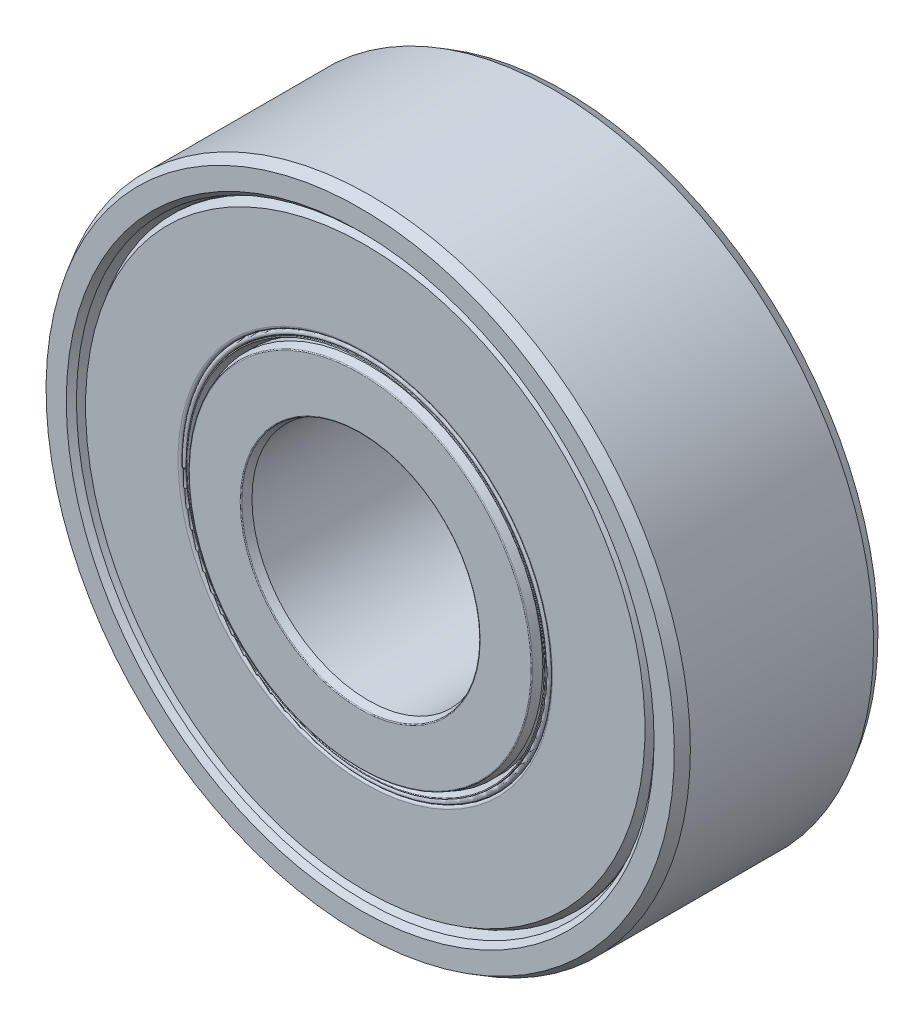
ISO-10303-21;
HEADER;
FILE_DESCRIPTION(('STEP AP214'),'2;1');
FILE_NAME('part.step','',(''),(''),'','','');
FILE_SCHEMA(('AUTOMOTIVE_DESIGN { 1 0 10303 214 1 1 1 1 }'));
ENDSEC;
DATA;
#1=APPLICATION_CONTEXT('core data for automotive mechanical design processes');
#2=APPLICATION_PROTOCOL_DEFINITION('international standard','automotive_design',2000,#1);
#3=PRODUCT_CONTEXT('',#1,'mechanical');
#4=PRODUCT('Part','Part','',(#3));
#5=PRODUCT_RELATED_PRODUCT_CATEGORY('part','',(#4));
#6=PRODUCT_DEFINITION_FORMATION('','',#4);
#7=PRODUCT_DEFINITION_CONTEXT('part definition',#1,'design');
#8=PRODUCT_DEFINITION('design','',#6,#7);
#9=PRODUCT_DEFINITION_SHAPE('','',#8);
#10=(LENGTH_UNIT() NAMED_UNIT(*) SI_UNIT(.MILLI.,.METRE.));
#11=(NAMED_UNIT(*) PLANE_ANGLE_UNIT() SI_UNIT($,.RADIAN.));
#12=(NAMED_UNIT(*) SI_UNIT($,.STERADIAN.) SOLID_ANGLE_UNIT());
#13=UNCERTAINTY_MEASURE_WITH_UNIT(LENGTH_MEASURE(1.E-05),#10,'distance_accuracy_value','');
#14=(GEOMETRIC_REPRESENTATION_CONTEXT(3) GLOBAL_UNCERTAINTY_ASSIGNED_CONTEXT((#13)) GLOBAL_UNIT_ASSIGNED_CONTEXT((#10,
#11,#12)) REPRESENTATION_CONTEXT('',''));
#15=CARTESIAN_POINT('',(0.,0.,0.));
#16=DIRECTION('',(0.,0.,1.));
#17=DIRECTION('',(1.,0.,0.));
#18=AXIS2_PLACEMENT_3D('',#15,#16,#17);
#19=CARTESIAN_POINT('',(0.,0.,3.5));
#20=DIRECTION('',(0.,0.,1.));
#21=DIRECTION('',(0.,-1.,0.));
#22=AXIS2_PLACEMENT_3D('',#19,#20,#21);
#23=CYLINDRICAL_SURFACE('',#22,6.34803966942149);
#24=CARTESIAN_POINT('',(0.,0.,-2.50098016528926));
#25=DIRECTION('',(0.,0.,1.));
#26=DIRECTION('',(0.,-1.,0.));
#27=AXIS2_PLACEMENT_3D('',#24,#25,#26);
#28=CIRCLE('',#27,6.34803966942149);
#29=CARTESIAN_POINT('',(0.,-6.34803966942148,-2.50098016528926));
#30=VERTEX_POINT('',#29);
#31=EDGE_CURVE('E11',#30,#30,#28,.T.);
#32=ORIENTED_EDGE('',*,*,#31,.F.);
#33=EDGE_LOOP('',(#32));
#34=FACE_BOUND('',#33,.T.);
#35=CARTESIAN_POINT('',(0.,0.,-3.2375));
#36=DIRECTION('',(0.,0.,1.));
#37=DIRECTION('',(0.,-1.,0.));
#38=AXIS2_PLACEMENT_3D('',#35,#36,#37);
#39=CIRCLE('',#38,6.34803966942149);
#40=CARTESIAN_POINT('',(0.,-6.34803966942149,-3.2375));
#41=VERTEX_POINT('',#40);
#42=EDGE_CURVE('E82',#41,#41,#39,.T.);
#43=ORIENTED_EDGE('',*,*,#42,.T.);
#44=EDGE_LOOP('',(#43));
#45=FACE_BOUND('',#44,.T.);
#46=ADVANCED_FACE('F50',(#34,#45),#23,.T.);
#47=CARTESIAN_POINT('',(0.,6.34803966942149,-2.50098016528926));
#48=DIRECTION('',(0.,0.,-1.));
#49=DIRECTION('',(0.,1.,0.));
#50=AXIS2_PLACEMENT_3D('',#47,#48,#49);
#51=PLANE('',#50);
#52=CARTESIAN_POINT('',(0.,0.,-2.50098016528926));
#53=DIRECTION('',(0.,0.,1.));
#54=DIRECTION('',(0.,-1.,0.));
#55=AXIS2_PLACEMENT_3D('',#52,#53,#54);
#56=CIRCLE('',#55,5.99803966942149);
#57=CARTESIAN_POINT('',(0.,-5.99803966942149,-2.50098016528926));
#58=VERTEX_POINT('',#57);
#59=EDGE_CURVE('E57',#58,#58,#56,.T.);
#60=ORIENTED_EDGE('',*,*,#59,.F.);
#61=EDGE_LOOP('',(#60));
#62=FACE_BOUND('',#61,.T.);
#63=ORIENTED_EDGE('',*,*,#31,.T.);
#64=EDGE_LOOP('',(#63));
#65=FACE_BOUND('',#64,.T.);
#66=ADVANCED_FACE('F113',(#62,#65),#51,.F.);
#67=CARTESIAN_POINT('',(0.,0.,3.5));
#68=DIRECTION('',(0.,0.,1.));
#69=DIRECTION('',(0.,-1.,0.));
#70=AXIS2_PLACEMENT_3D('',#67,#68,#69);
#71=CYLINDRICAL_SURFACE('',#70,5.99803966942149);
#72=CARTESIAN_POINT('',(0.,0.,-2.92593888343875));
#73=DIRECTION('',(0.,0.,1.));
#74=DIRECTION('',(0.,-1.,0.));
#75=AXIS2_PLACEMENT_3D('',#72,#73,#74);
#76=CIRCLE('',#75,5.99803966942149);
#77=CARTESIAN_POINT('',(0.,-5.99803966942149,-2.92593888343875));
#78=VERTEX_POINT('',#77);
#79=EDGE_CURVE('E63',#78,#78,#76,.T.);
#80=ORIENTED_EDGE('',*,*,#79,.F.);
#81=EDGE_LOOP('',(#80));
#82=FACE_BOUND('',#81,.T.);
#83=ORIENTED_EDGE('',*,*,#59,.T.);
#84=EDGE_LOOP('',(#83));
#85=FACE_BOUND('',#84,.T.);
#86=ADVANCED_FACE('F108',(#82,#85),#71,.F.);
#87=CARTESIAN_POINT('',(0.,0.,-2.92593888343875));
#88=DIRECTION('',(0.,0.,-1.));
#89=DIRECTION('',(0.,1.,0.));
#90=AXIS2_PLACEMENT_3D('',#87,#88,#89);
#91=CONICAL_SURFACE('',#90,5.99803966942149,0.349065850398868);
#92=CARTESIAN_POINT('',(0.,0.,-3.3134853525082));
#93=DIRECTION('',(0.,0.,1.));
#94=DIRECTION('',(0.,-1.,0.));
#95=AXIS2_PLACEMENT_3D('',#92,#93,#94);
#96=CIRCLE('',#95,6.13909504855773);
#97=CARTESIAN_POINT('',(0.,-6.13909504855773,-3.3134853525082));
#98=VERTEX_POINT('',#97);
#99=EDGE_CURVE('E69',#98,#98,#96,.T.);
#100=ORIENTED_EDGE('',*,*,#99,.F.);
#101=EDGE_LOOP('',(#100));
#102=FACE_BOUND('',#101,.T.);
#103=ORIENTED_EDGE('',*,*,#79,.T.);
#104=EDGE_LOOP('',(#103));
#105=FACE_BOUND('',#104,.T.);
#106=ADVANCED_FACE('F102',(#102,#105),#91,.F.);
#107=CARTESIAN_POINT('',(0.,0.,-3.3075));
#108=DIRECTION('',(0.,0.,1.));
#109=DIRECTION('',(0.,-1.,0.));
#110=AXIS2_PLACEMENT_3D('',#107,#108,#109);
#111=TOROIDAL_SURFACE('',#110,6.15553966942149,0.0174999999999998);
#112=CARTESIAN_POINT('',(0.,0.,-3.3075));
#113=DIRECTION('',(0.,0.,1.));
#114=DIRECTION('',(0.,-1.,0.));
#115=AXIS2_PLACEMENT_3D('',#112,#113,#114);
#116=CIRCLE('',#115,6.17303966942149);
#117=CARTESIAN_POINT('',(0.,-6.17303966942149,-3.3075));
#118=VERTEX_POINT('',#117);
#119=EDGE_CURVE('E75',#118,#118,#116,.T.);
#120=ORIENTED_EDGE('',*,*,#119,.F.);
#121=EDGE_LOOP('',(#120));
#122=FACE_BOUND('',#121,.T.);
#123=ORIENTED_EDGE('',*,*,#99,.T.);
#124=EDGE_LOOP('',(#123));
#125=FACE_BOUND('',#124,.T.);
#126=ADVANCED_FACE('F96',(#122,#125),#111,.T.);
#127=CARTESIAN_POINT('',(0.,0.,3.5));
#128=DIRECTION('',(0.,0.,1.));
#129=DIRECTION('',(0.,-1.,0.));
#130=AXIS2_PLACEMENT_3D('',#127,#128,#129);
#131=CYLINDRICAL_SURFACE('',#130,6.17303966942149);
#132=CARTESIAN_POINT('',(0.,0.,-3.2375));
#133=DIRECTION('',(0.,0.,1.));
#134=DIRECTION('',(0.,-1.,0.));
#135=AXIS2_PLACEMENT_3D('',#132,#133,#134);
#136=CIRCLE('',#135,6.17303966942149);
#137=CARTESIAN_POINT('',(0.,-6.17303966942149,-3.2375));
#138=VERTEX_POINT('',#137);
#139=EDGE_CURVE('E79',#138,#138,#136,.T.);
#140=ORIENTED_EDGE('',*,*,#139,.F.);
#141=EDGE_LOOP('',(#140));
#142=FACE_BOUND('',#141,.T.);
#143=ORIENTED_EDGE('',*,*,#119,.T.);
#144=EDGE_LOOP('',(#143));
#145=FACE_BOUND('',#144,.T.);
#146=ADVANCED_FACE('F90',(#142,#145),#131,.T.);
#147=CARTESIAN_POINT('',(0.,0.,-3.2375));
#148=DIRECTION('',(0.,0.,1.));
#149=DIRECTION('',(0.,-1.,0.));
#150=AXIS2_PLACEMENT_3D('',#147,#148,#149);
#151=TOROIDAL_SURFACE('',#150,6.26053966942149,0.0875000000000008);
#152=ORIENTED_EDGE('',*,*,#42,.F.);
#153=EDGE_LOOP('',(#152));
#154=FACE_BOUND('',#153,.T.);
#155=ORIENTED_EDGE('',*,*,#139,.T.);
#156=EDGE_LOOP('',(#155));
#157=FACE_BOUND('',#156,.T.);
#158=ADVANCED_FACE('F87',(#154,#157),#151,.T.);
#159=CLOSED_SHELL('',(#46,#66,#86,#106,#126,#146,#158));
#160=MANIFOLD_SOLID_BREP('B2',#159);
#161=CARTESIAN_POINT('',(0.,6.34803966942149,2.50098016528926));
#162=DIRECTION('',(0.,0.,1.));
#163=DIRECTION('',(0.,-1.,0.));
#164=AXIS2_PLACEMENT_3D('',#161,#162,#163);
#165=PLANE('',#164);
#166=CARTESIAN_POINT('',(0.,0.,2.50098016528926));
#167=DIRECTION('',(0.,0.,1.));
#168=DIRECTION('',(0.,-1.,0.));
#169=AXIS2_PLACEMENT_3D('',#166,#167,#168);
#170=CIRCLE('',#169,6.34803966942149);
#171=CARTESIAN_POINT('',(0.,-6.34803966942149,2.50098016528925));
#172=VERTEX_POINT('',#171);
#173=EDGE_CURVE('E197',#172,#172,#170,.T.);
#174=ORIENTED_EDGE('',*,*,#173,.F.);
#175=EDGE_LOOP('',(#174));
#176=FACE_BOUND('',#175,.T.);
#177=CARTESIAN_POINT('',(0.,0.,2.50098016528926));
#178=DIRECTION('',(0.,0.,1.));
#179=DIRECTION('',(0.,-1.,0.));
#180=AXIS2_PLACEMENT_3D('',#177,#178,#179);
#181=CIRCLE('',#180,5.99803966942149);
#182=CARTESIAN_POINT('',(0.,-5.99803966942149,2.50098016528925));
#183=VERTEX_POINT('',#182);
#184=EDGE_CURVE('E49',#183,#183,#181,.T.);
#185=ORIENTED_EDGE('',*,*,#184,.T.);
#186=EDGE_LOOP('',(#185));
#187=FACE_BOUND('',#186,.T.);
#188=ADVANCED_FACE('F165',(#176,#187),#165,.F.);
#189=CARTESIAN_POINT('',(0.,0.,3.5));
#190=DIRECTION('',(0.,0.,1.));
#191=DIRECTION('',(0.,-1.,0.));
#192=AXIS2_PLACEMENT_3D('',#189,#190,#191);
#193=CYLINDRICAL_SURFACE('',#192,5.99803966942149);
#194=ORIENTED_EDGE('',*,*,#184,.F.);
#195=EDGE_LOOP('',(#194));
#196=FACE_BOUND('',#195,.T.);
#197=CARTESIAN_POINT('',(0.,0.,2.92593888343875));
#198=DIRECTION('',(0.,0.,1.));
#199=DIRECTION('',(0.,-1.,0.));
#200=AXIS2_PLACEMENT_3D('',#197,#198,#199);
#201=CIRCLE('',#200,5.99803966942149);
#202=CARTESIAN_POINT('',(0.,-5.99803966942149,2.92593888343875));
#203=VERTEX_POINT('',#202);
#204=EDGE_CURVE('E172',#203,#203,#201,.T.);
#205=ORIENTED_EDGE('',*,*,#204,.T.);
#206=EDGE_LOOP('',(#205));
#207=FACE_BOUND('',#206,.T.);
#208=ADVANCED_FACE('F204',(#196,#207),#193,.F.);
#209=CARTESIAN_POINT('',(0.,0.,3.3134853525082));
#210=DIRECTION('',(0.,0.,1.));
#211=DIRECTION('',(0.,-1.,0.));
#212=AXIS2_PLACEMENT_3D('',#209,#210,#211);
#213=CONICAL_SURFACE('',#212,6.13909504855773,0.349065850398868);
#214=ORIENTED_EDGE('',*,*,#204,.F.);
#215=EDGE_LOOP('',(#214));
#216=FACE_BOUND('',#215,.T.);
#217=CARTESIAN_POINT('',(0.,0.,3.3134853525082));
#218=DIRECTION('',(0.,0.,1.));
#219=DIRECTION('',(0.,-1.,0.));
#220=AXIS2_PLACEMENT_3D('',#217,#218,#219);
#221=CIRCLE('',#220,6.13909504855773);
#222=CARTESIAN_POINT('',(0.,-6.13909504855773,3.3134853525082));
#223=VERTEX_POINT('',#222);
#224=EDGE_CURVE('E178',#223,#223,#221,.T.);
#225=ORIENTED_EDGE('',*,*,#224,.T.);
#226=EDGE_LOOP('',(#225));
#227=FACE_BOUND('',#226,.T.);
#228=ADVANCED_FACE('F208',(#216,#227),#213,.F.);
#229=CARTESIAN_POINT('',(0.,0.,3.3075));
#230=DIRECTION('',(0.,0.,1.));
#231=DIRECTION('',(0.,-1.,0.));
#232=AXIS2_PLACEMENT_3D('',#229,#230,#231);
#233=TOROIDAL_SURFACE('',#232,6.15553966942149,0.0174999999999998);
#234=ORIENTED_EDGE('',*,*,#224,.F.);
#235=EDGE_LOOP('',(#234));
#236=FACE_BOUND('',#235,.T.);
#237=CARTESIAN_POINT('',(0.,0.,3.3075));
#238=DIRECTION('',(0.,0.,1.));
#239=DIRECTION('',(0.,-1.,0.));
#240=AXIS2_PLACEMENT_3D('',#237,#238,#239);
#241=CIRCLE('',#240,6.17303966942149);
#242=CARTESIAN_POINT('',(0.,-6.17303966942149,3.3075));
#243=VERTEX_POINT('',#242);
#244=EDGE_CURVE('E184',#243,#243,#241,.T.);
#245=ORIENTED_EDGE('',*,*,#244,.T.);
#246=EDGE_LOOP('',(#245));
#247=FACE_BOUND('',#246,.T.);
#248=ADVANCED_FACE('F213',(#236,#247),#233,.T.);
#249=CARTESIAN_POINT('',(0.,0.,3.5));
#250=DIRECTION('',(0.,0.,1.));
#251=DIRECTION('',(0.,-1.,0.));
#252=AXIS2_PLACEMENT_3D('',#249,#250,#251);
#253=CYLINDRICAL_SURFACE('',#252,6.17303966942149);
#254=ORIENTED_EDGE('',*,*,#244,.F.);
#255=EDGE_LOOP('',(#254));
#256=FACE_BOUND('',#255,.T.);
#257=CARTESIAN_POINT('',(0.,0.,3.2375));
#258=DIRECTION('',(0.,0.,1.));
#259=DIRECTION('',(0.,-1.,0.));
#260=AXIS2_PLACEMENT_3D('',#257,#258,#259);
#261=CIRCLE('',#260,6.17303966942149);
#262=CARTESIAN_POINT('',(0.,-6.17303966942149,3.2375));
#263=VERTEX_POINT('',#262);
#264=EDGE_CURVE('E190',#263,#263,#261,.T.);
#265=ORIENTED_EDGE('',*,*,#264,.T.);
#266=EDGE_LOOP('',(#265));
#267=FACE_BOUND('',#266,.T.);
#268=ADVANCED_FACE('F219',(#256,#267),#253,.T.);
#269=CARTESIAN_POINT('',(0.,0.,3.2375));
#270=DIRECTION('',(0.,0.,1.));
#271=DIRECTION('',(0.,-1.,0.));
#272=AXIS2_PLACEMENT_3D('',#269,#270,#271);
#273=TOROIDAL_SURFACE('',#272,6.26053966942149,0.0875000000000008);
#274=ORIENTED_EDGE('',*,*,#264,.F.);
#275=EDGE_LOOP('',(#274));
#276=FACE_BOUND('',#275,.T.);
#277=CARTESIAN_POINT('',(0.,0.,3.2375));
#278=DIRECTION('',(0.,0.,1.));
#279=DIRECTION('',(0.,-1.,0.));
#280=AXIS2_PLACEMENT_3D('',#277,#278,#279);
#281=CIRCLE('',#280,6.34803966942149);
#282=CARTESIAN_POINT('',(0.,-6.34803966942149,3.2375));
#283=VERTEX_POINT('',#282);
#284=EDGE_CURVE('E193',#283,#283,#281,.T.);
#285=ORIENTED_EDGE('',*,*,#284,.T.);
#286=EDGE_LOOP('',(#285));
#287=FACE_BOUND('',#286,.T.);
#288=ADVANCED_FACE('F223',(#276,#287),#273,.T.);
#289=CARTESIAN_POINT('',(0.,0.,3.5));
#290=DIRECTION('',(0.,0.,1.));
#291=DIRECTION('',(0.,-1.,0.));
#292=AXIS2_PLACEMENT_3D('',#289,#290,#291);
#293=CYLINDRICAL_SURFACE('',#292,6.34803966942149);
#294=ORIENTED_EDGE('',*,*,#284,.F.);
#295=EDGE_LOOP('',(#294));
#296=FACE_BOUND('',#295,.T.);
#297=ORIENTED_EDGE('',*,*,#173,.T.);
#298=EDGE_LOOP('',(#297));
#299=FACE_BOUND('',#298,.T.);
#300=ADVANCED_FACE('F201',(#296,#299),#293,.T.);
#301=CLOSED_SHELL('',(#188,#208,#228,#248,#268,#288,#300));
#302=MANIFOLD_SOLID_BREP('B6',#301);
#303=CARTESIAN_POINT('',(0.,0.,-3.325));
#304=DIRECTION('',(0.,0.,1.));
#305=DIRECTION('',(0.,-1.,0.));
#306=AXIS2_PLACEMENT_3D('',#303,#304,#305);
#307=CONICAL_SURFACE('',#306,9.615,0.52359877559829);
#308=CARTESIAN_POINT('',(0.,0.,-3.02189110867545));
#309=DIRECTION('',(0.,0.,1.));
#310=DIRECTION('',(0.,-1.,0.));
#311=AXIS2_PLACEMENT_3D('',#308,#309,#310);
#312=CIRCLE('',#311,9.79);
#313=CARTESIAN_POINT('',(0.,-9.79,-3.02189110867545));
#314=VERTEX_POINT('',#313);
#315=EDGE_CURVE('E301',#314,#314,#312,.T.);
#316=ORIENTED_EDGE('',*,*,#315,.F.);
#317=EDGE_LOOP('',(#316));
#318=FACE_BOUND('',#317,.T.);
#319=CARTESIAN_POINT('',(0.,0.,-3.325));
#320=DIRECTION('',(0.,0.,1.));
#321=DIRECTION('',(0.,-1.,0.));
#322=AXIS2_PLACEMENT_3D('',#319,#320,#321);
#323=CIRCLE('',#322,9.615);
#324=CARTESIAN_POINT('',(0.,-9.615,-3.32500000000001));
#325=VERTEX_POINT('',#324);
#326=EDGE_CURVE('E164',#325,#325,#323,.T.);
#327=ORIENTED_EDGE('',*,*,#326,.T.);
#328=EDGE_LOOP('',(#327));
#329=FACE_BOUND('',#328,.T.);
#330=ADVANCED_FACE('F273',(#318,#329),#307,.T.);
#331=CARTESIAN_POINT('',(0.,9.615,-3.325));
#332=DIRECTION('',(0.,0.,1.));
#333=DIRECTION('',(0.,-1.,0.));
#334=AXIS2_PLACEMENT_3D('',#331,#332,#333);
#335=PLANE('',#334);
#336=ORIENTED_EDGE('',*,*,#326,.F.);
#337=EDGE_LOOP('',(#336));
#338=FACE_BOUND('',#337,.T.);
#339=CARTESIAN_POINT('',(0.,0.,-3.325));
#340=DIRECTION('',(0.,0.,1.));
#341=DIRECTION('',(0.,-1.,0.));
#342=AXIS2_PLACEMENT_3D('',#339,#340,#341);
#343=CIRCLE('',#342,6.43553966942149);
#344=CARTESIAN_POINT('',(0.,-6.43553966942149,-3.32500000000001));
#345=VERTEX_POINT('',#344);
#346=EDGE_CURVE('E280',#345,#345,#343,.T.);
#347=ORIENTED_EDGE('',*,*,#346,.T.);
#348=EDGE_LOOP('',(#347));
#349=FACE_BOUND('',#348,.T.);
#350=ADVANCED_FACE('F308',(#338,#349),#335,.F.);
#351=CARTESIAN_POINT('',(0.,0.,-3.2375));
#352=DIRECTION('',(0.,0.,1.));
#353=DIRECTION('',(0.,-1.,0.));
#354=AXIS2_PLACEMENT_3D('',#351,#352,#353);
#355=TOROIDAL_SURFACE('',#354,6.43553966942149,0.0874999999999997);
#356=ORIENTED_EDGE('',*,*,#346,.F.);
#357=EDGE_LOOP('',(#356));
#358=FACE_BOUND('',#357,.T.);
#359=CARTESIAN_POINT('',(0.,0.,-3.2375));
#360=DIRECTION('',(0.,0.,1.));
#361=DIRECTION('',(0.,-1.,0.));
#362=AXIS2_PLACEMENT_3D('',#359,#360,#361);
#363=CIRCLE('',#362,6.34803966942149);
#364=CARTESIAN_POINT('',(0.,-6.34803966942149,-3.2375));
#365=VERTEX_POINT('',#364);
#366=EDGE_CURVE('E287',#365,#365,#363,.T.);
#367=ORIENTED_EDGE('',*,*,#366,.T.);
#368=EDGE_LOOP('',(#367));
#369=FACE_BOUND('',#368,.T.);
#370=ADVANCED_FACE('F312',(#358,#369),#355,.T.);
#371=CARTESIAN_POINT('',(0.,0.,3.5));
#372=DIRECTION('',(0.,0.,1.));
#373=DIRECTION('',(0.,-1.,0.));
#374=AXIS2_PLACEMENT_3D('',#371,#372,#373);
#375=CYLINDRICAL_SURFACE('',#374,6.34803966942149);
#376=ORIENTED_EDGE('',*,*,#366,.F.);
#377=EDGE_LOOP('',(#376));
#378=FACE_BOUND('',#377,.T.);
#379=CARTESIAN_POINT('',(0.,0.,-2.50098016528926));
#380=DIRECTION('',(0.,0.,1.));
#381=DIRECTION('',(0.,-1.,0.));
#382=AXIS2_PLACEMENT_3D('',#379,#380,#381);
#383=CIRCLE('',#382,6.34803966942149);
#384=CARTESIAN_POINT('',(0.,-6.34803966942149,-2.50098016528926));
#385=VERTEX_POINT('',#384);
#386=EDGE_CURVE('E292',#385,#385,#383,.T.);
#387=ORIENTED_EDGE('',*,*,#386,.T.);
#388=EDGE_LOOP('',(#387));
#389=FACE_BOUND('',#388,.T.);
#390=ADVANCED_FACE('F318',(#378,#389),#375,.F.);
#391=CARTESIAN_POINT('',(0.,9.79,-2.50098016528926));
#392=DIRECTION('',(0.,0.,-1.));
#393=DIRECTION('',(0.,1.,0.));
#394=AXIS2_PLACEMENT_3D('',#391,#392,#393);
#395=PLANE('',#394);
#396=ORIENTED_EDGE('',*,*,#386,.F.);
#397=EDGE_LOOP('',(#396));
#398=FACE_BOUND('',#397,.T.);
#399=CARTESIAN_POINT('',(0.,0.,-2.50098016528926));
#400=DIRECTION('',(0.,0.,1.));
#401=DIRECTION('',(0.,-1.,0.));
#402=AXIS2_PLACEMENT_3D('',#399,#400,#401);
#403=CIRCLE('',#402,9.79);
#404=CARTESIAN_POINT('',(0.,-9.79,-2.50098016528926));
#405=VERTEX_POINT('',#404);
#406=EDGE_CURVE('E297',#405,#405,#403,.T.);
#407=ORIENTED_EDGE('',*,*,#406,.T.);
#408=EDGE_LOOP('',(#407));
#409=FACE_BOUND('',#408,.T.);
#410=ADVANCED_FACE('F323',(#398,#409),#395,.F.);
#411=CARTESIAN_POINT('',(0.,0.,3.5));
#412=DIRECTION('',(0.,0.,1.));
#413=DIRECTION('',(0.,-1.,0.));
#414=AXIS2_PLACEMENT_3D('',#411,#412,#413);
#415=CYLINDRICAL_SURFACE('',#414,9.79);
#416=ORIENTED_EDGE('',*,*,#406,.F.);
#417=EDGE_LOOP('',(#416));
#418=FACE_BOUND('',#417,.T.);
#419=ORIENTED_EDGE('',*,*,#315,.T.);
#420=EDGE_LOOP('',(#419));
#421=FACE_BOUND('',#420,.T.);
#422=ADVANCED_FACE('F305',(#418,#421),#415,.T.);
#423=CLOSED_SHELL('',(#330,#350,#370,#390,#410,#422));
#424=MANIFOLD_SOLID_BREP('B44',#423);
#425=CARTESIAN_POINT('',(0.,9.79,2.50098016528926));
#426=DIRECTION('',(0.,0.,1.));
#427=DIRECTION('',(0.,-1.,0.));
#428=AXIS2_PLACEMENT_3D('',#425,#426,#427);
#429=PLANE('',#428);
#430=CARTESIAN_POINT('',(0.,0.,2.50098016528925));
#431=DIRECTION('',(0.,0.,1.));
#432=DIRECTION('',(0.,-1.,0.));
#433=AXIS2_PLACEMENT_3D('',#430,#431,#432);
#434=CIRCLE('',#433,9.79);
#435=CARTESIAN_POINT('',(0.,-9.79,2.50098016528925));
#436=VERTEX_POINT('',#435);
#437=EDGE_CURVE('E272',#436,#436,#434,.T.);
#438=ORIENTED_EDGE('',*,*,#437,.F.);
#439=EDGE_LOOP('',(#438));
#440=FACE_BOUND('',#439,.T.);
#441=CARTESIAN_POINT('',(0.,0.,2.50098016528926));
#442=DIRECTION('',(0.,0.,1.));
#443=DIRECTION('',(0.,-1.,0.));
#444=AXIS2_PLACEMENT_3D('',#441,#442,#443);
#445=CIRCLE('',#444,6.34803966942149);
#446=CARTESIAN_POINT('',(0.,-6.34803966942149,2.50098016528925));
#447=VERTEX_POINT('',#446);
#448=EDGE_CURVE('E398',#447,#447,#445,.T.);
#449=ORIENTED_EDGE('',*,*,#448,.T.);
#450=EDGE_LOOP('',(#449));
#451=FACE_BOUND('',#450,.T.);
#452=ADVANCED_FACE('F371',(#440,#451),#429,.F.);
#453=CARTESIAN_POINT('',(0.,0.,3.5));
#454=DIRECTION('',(0.,0.,1.));
#455=DIRECTION('',(0.,-1.,0.));
#456=AXIS2_PLACEMENT_3D('',#453,#454,#455);
#457=CYLINDRICAL_SURFACE('',#456,9.79);
#458=CARTESIAN_POINT('',(0.,0.,3.02189110867544));
#459=DIRECTION('',(0.,0.,1.));
#460=DIRECTION('',(0.,-1.,0.));
#461=AXIS2_PLACEMENT_3D('',#458,#459,#460);
#462=CIRCLE('',#461,9.79);
#463=CARTESIAN_POINT('',(0.,-9.79,3.02189110867544));
#464=VERTEX_POINT('',#463);
#465=EDGE_CURVE('E378',#464,#464,#462,.T.);
#466=ORIENTED_EDGE('',*,*,#465,.F.);
#467=EDGE_LOOP('',(#466));
#468=FACE_BOUND('',#467,.T.);
#469=ORIENTED_EDGE('',*,*,#437,.T.);
#470=EDGE_LOOP('',(#469));
#471=FACE_BOUND('',#470,.T.);
#472=ADVANCED_FACE('F424',(#468,#471),#457,.T.);
#473=CARTESIAN_POINT('',(0.,0.,3.02189110867544));
#474=DIRECTION('',(0.,0.,-1.));
#475=DIRECTION('',(0.,1.,0.));
#476=AXIS2_PLACEMENT_3D('',#473,#474,#475);
#477=CONICAL_SURFACE('',#476,9.79,0.52359877559829);
#478=CARTESIAN_POINT('',(0.,0.,3.325));
#479=DIRECTION('',(0.,0.,1.));
#480=DIRECTION('',(0.,-1.,0.));
#481=AXIS2_PLACEMENT_3D('',#478,#479,#480);
#482=CIRCLE('',#481,9.615);
#483=CARTESIAN_POINT('',(0.,-9.615,3.325));
#484=VERTEX_POINT('',#483);
#485=EDGE_CURVE('E384',#484,#484,#482,.T.);
#486=ORIENTED_EDGE('',*,*,#485,.F.);
#487=EDGE_LOOP('',(#486));
#488=FACE_BOUND('',#487,.T.);
#489=ORIENTED_EDGE('',*,*,#465,.T.);
#490=EDGE_LOOP('',(#489));
#491=FACE_BOUND('',#490,.T.);
#492=ADVANCED_FACE('F419',(#488,#491),#477,.T.);
#493=CARTESIAN_POINT('',(0.,9.615,3.325));
#494=DIRECTION('',(0.,0.,-1.));
#495=DIRECTION('',(0.,1.,0.));
#496=AXIS2_PLACEMENT_3D('',#493,#494,#495);
#497=PLANE('',#496);
#498=CARTESIAN_POINT('',(0.,0.,3.325));
#499=DIRECTION('',(0.,0.,1.));
#500=DIRECTION('',(0.,-1.,0.));
#501=AXIS2_PLACEMENT_3D('',#498,#499,#500);
#502=CIRCLE('',#501,6.43553966942149);
#503=CARTESIAN_POINT('',(0.,-6.43553966942149,3.325));
#504=VERTEX_POINT('',#503);
#505=EDGE_CURVE('E389',#504,#504,#502,.T.);
#506=ORIENTED_EDGE('',*,*,#505,.F.);
#507=EDGE_LOOP('',(#506));
#508=FACE_BOUND('',#507,.T.);
#509=ORIENTED_EDGE('',*,*,#485,.T.);
#510=EDGE_LOOP('',(#509));
#511=FACE_BOUND('',#510,.T.);
#512=ADVANCED_FACE('F413',(#508,#511),#497,.F.);
#513=CARTESIAN_POINT('',(0.,0.,3.2375));
#514=DIRECTION('',(0.,0.,1.));
#515=DIRECTION('',(0.,-1.,0.));
#516=AXIS2_PLACEMENT_3D('',#513,#514,#515);
#517=TOROIDAL_SURFACE('',#516,6.43553966942149,0.0874999999999997);
#518=CARTESIAN_POINT('',(0.,0.,3.2375));
#519=DIRECTION('',(0.,0.,1.));
#520=DIRECTION('',(0.,-1.,0.));
#521=AXIS2_PLACEMENT_3D('',#518,#519,#520);
#522=CIRCLE('',#521,6.34803966942149);
#523=CARTESIAN_POINT('',(0.,-6.34803966942149,3.2375));
#524=VERTEX_POINT('',#523);
#525=EDGE_CURVE('E394',#524,#524,#522,.T.);
#526=ORIENTED_EDGE('',*,*,#525,.F.);
#527=EDGE_LOOP('',(#526));
#528=FACE_BOUND('',#527,.T.);
#529=ORIENTED_EDGE('',*,*,#505,.T.);
#530=EDGE_LOOP('',(#529));
#531=FACE_BOUND('',#530,.T.);
#532=ADVANCED_FACE('F407',(#528,#531),#517,.T.);
#533=CARTESIAN_POINT('',(0.,0.,3.5));
#534=DIRECTION('',(0.,0.,1.));
#535=DIRECTION('',(0.,-1.,0.));
#536=AXIS2_PLACEMENT_3D('',#533,#534,#535);
#537=CYLINDRICAL_SURFACE('',#536,6.34803966942149);
#538=ORIENTED_EDGE('',*,*,#448,.F.);
#539=EDGE_LOOP('',(#538));
#540=FACE_BOUND('',#539,.T.);
#541=ORIENTED_EDGE('',*,*,#525,.T.);
#542=EDGE_LOOP('',(#541));
#543=FACE_BOUND('',#542,.T.);
#544=ADVANCED_FACE('F404',(#540,#543),#537,.F.);
#545=CLOSED_SHELL('',(#452,#472,#492,#512,#532,#544));
#546=MANIFOLD_SOLID_BREP('B159',#545);
#547=CARTESIAN_POINT('',(-6.17179323000387,4.92184086261279,0.));
#548=DIRECTION('',(0.,0.,1.));
#549=DIRECTION('',(-0.781831482468022,0.623489801858743,0.));
#550=AXIS2_PLACEMENT_3D('',#547,#548,#549);
#551=SPHERICAL_SURFACE('',#550,2.50098016528926);
#552=CARTESIAN_POINT('',(-6.17179323000387,4.92184086261279,2.50098016528925));
#553=VERTEX_POINT('',#552);
#554=VERTEX_LOOP('',#553);
#555=FACE_BOUND('',#554,.T.);
#556=ADVANCED_FACE('F483',(#555),#551,.T.);
#557=CLOSED_SHELL('',(#556));
#558=MANIFOLD_SOLID_BREP('B267',#557);
#559=CARTESIAN_POINT('',(-7.69610027617647,-1.75658466628943,0.));
#560=DIRECTION('',(0.,0.,1.));
#561=DIRECTION('',(-0.974927912181826,-0.222520933956305,0.));
#562=AXIS2_PLACEMENT_3D('',#559,#560,#561);
#563=SPHERICAL_SURFACE('',#562,2.50098016528926);
#564=CARTESIAN_POINT('',(-7.69610027617647,-1.75658466628943,2.50098016528925));
#565=VERTEX_POINT('',#564);
#566=VERTEX_LOOP('',#565);
#567=FACE_BOUND('',#566,.T.);
#568=ADVANCED_FACE('F500',(#567),#563,.T.);
#569=CLOSED_SHELL('',(#568));
#570=MANIFOLD_SOLID_BREP('B367',#569);
#571=CARTESIAN_POINT('',(-3.42508684255252,-7.11226611367855,0.));
#572=DIRECTION('',(0.,0.,1.));
#573=DIRECTION('',(-0.433883739117565,-0.900968867902416,0.));
#574=AXIS2_PLACEMENT_3D('',#571,#572,#573);
#575=SPHERICAL_SURFACE('',#574,2.50098016528926);
#576=CARTESIAN_POINT('',(-3.42508684255252,-7.11226611367855,2.50098016528925));
#577=VERTEX_POINT('',#576);
#578=VERTEX_LOOP('',#577);
#579=FACE_BOUND('',#578,.T.);
#580=ADVANCED_FACE('F517',(#579),#575,.T.);
#581=CLOSED_SHELL('',(#580));
#582=MANIFOLD_SOLID_BREP('B479',#581);
#583=CARTESIAN_POINT('',(3.42508684255242,-7.1122661136786,0.));
#584=DIRECTION('',(0.,0.,1.));
#585=DIRECTION('',(0.433883739117553,-0.900968867902422,0.));
#586=AXIS2_PLACEMENT_3D('',#583,#584,#585);
#587=SPHERICAL_SURFACE('',#586,2.50098016528926);
#588=CARTESIAN_POINT('',(3.42508684255242,-7.1122661136786,2.50098016528925));
#589=VERTEX_POINT('',#588);
#590=VERTEX_LOOP('',#589);
#591=FACE_BOUND('',#590,.T.);
#592=ADVANCED_FACE('F534',(#591),#587,.T.);
#593=CLOSED_SHELL('',(#592));
#594=MANIFOLD_SOLID_BREP('B496',#593);
#595=CARTESIAN_POINT('',(7.69610027617644,-1.75658466628954,0.));
#596=DIRECTION('',(0.,0.,1.));
#597=DIRECTION('',(0.974927912181823,-0.222520933956318,0.));
#598=AXIS2_PLACEMENT_3D('',#595,#596,#597);
#599=SPHERICAL_SURFACE('',#598,2.50098016528926);
#600=CARTESIAN_POINT('',(7.69610027617644,-1.75658466628954,2.50098016528925));
#601=VERTEX_POINT('',#600);
#602=VERTEX_LOOP('',#601);
#603=FACE_BOUND('',#602,.T.);
#604=ADVANCED_FACE('F551',(#603),#599,.T.);
#605=CLOSED_SHELL('',(#604));
#606=MANIFOLD_SOLID_BREP('B513',#605);
#607=CARTESIAN_POINT('',(6.17179323000394,4.9218408626127,0.));
#608=DIRECTION('',(0.,0.,1.));
#609=DIRECTION('',(0.781831482468031,0.623489801858732,0.));
#610=AXIS2_PLACEMENT_3D('',#607,#608,#609);
#611=SPHERICAL_SURFACE('',#610,2.50098016528926);
#612=CARTESIAN_POINT('',(6.17179323000394,4.9218408626127,2.50098016528925));
#613=VERTEX_POINT('',#612);
#614=VERTEX_LOOP('',#613);
#615=FACE_BOUND('',#614,.T.);
#616=ADVANCED_FACE('F568',(#615),#611,.T.);
#617=CLOSED_SHELL('',(#616));
#618=MANIFOLD_SOLID_BREP('B530',#617);
#619=CARTESIAN_POINT('',(0.,7.89401983471074,0.));
#620=DIRECTION('',(0.,0.,1.));
#621=DIRECTION('',(0.,1.,0.));
#622=AXIS2_PLACEMENT_3D('',#619,#620,#621);
#623=SPHERICAL_SURFACE('',#622,2.50098016528926);
#624=CARTESIAN_POINT('',(0.,7.89401983471074,2.50098016528926));
#625=VERTEX_POINT('',#624);
#626=VERTEX_LOOP('',#625);
#627=FACE_BOUND('',#626,.T.);
#628=ADVANCED_FACE('F587',(#627),#623,.T.);
#629=CLOSED_SHELL('',(#628));
#630=MANIFOLD_SOLID_BREP('B547',#629);
#631=CARTESIAN_POINT('',(0.,0.,-3.465));
#632=DIRECTION('',(0.,0.,1.));
#633=DIRECTION('',(0.,-1.,0.));
#634=AXIS2_PLACEMENT_3D('',#631,#632,#633);
#635=TOROIDAL_SURFACE('',#634,4.12641892943188,0.0349999999999996);
#636=CARTESIAN_POINT('',(0.,0.,-3.5));
#637=DIRECTION('',(0.,0.,1.));
#638=DIRECTION('',(0.,-1.,0.));
#639=AXIS2_PLACEMENT_3D('',#636,#637,#638);
#640=CIRCLE('',#639,4.12641892943188);
#641=CARTESIAN_POINT('',(0.,-4.12641892943187,-3.5));
#642=VERTEX_POINT('',#641);
#643=EDGE_CURVE('E586',#642,#642,#640,.T.);
#644=ORIENTED_EDGE('',*,*,#643,.F.);
#645=EDGE_LOOP('',(#644));
#646=FACE_BOUND('',#645,.T.);
#647=CARTESIAN_POINT('',(0.,0.,-3.4769707050164));
#648=DIRECTION('',(0.,0.,1.));
#649=DIRECTION('',(0.,-1.,0.));
#650=AXIS2_PLACEMENT_3D('',#647,#648,#649);
#651=CIRCLE('',#650,4.09352968770437);
#652=CARTESIAN_POINT('',(0.,-4.09352968770437,-3.4769707050164));
#653=VERTEX_POINT('',#652);
#654=EDGE_CURVE('E666',#653,#653,#651,.T.);
#655=ORIENTED_EDGE('',*,*,#654,.T.);
#656=EDGE_LOOP('',(#655));
#657=FACE_BOUND('',#656,.T.);
#658=ADVANCED_FACE('F606',(#646,#657),#635,.T.);
#659=CARTESIAN_POINT('',(0.,4.12641892943188,-3.5));
#660=DIRECTION('',(0.,0.,1.));
#661=DIRECTION('',(0.,-1.,0.));
#662=AXIS2_PLACEMENT_3D('',#659,#660,#661);
#663=PLANE('',#662);
#664=CARTESIAN_POINT('',(0.,0.,-3.5));
#665=DIRECTION('',(0.,0.,1.));
#666=DIRECTION('',(0.,-1.,0.));
#667=AXIS2_PLACEMENT_3D('',#664,#665,#666);
#668=CIRCLE('',#667,5.87162073998961);
#669=CARTESIAN_POINT('',(0.,-5.87162073998961,-3.5));
#670=VERTEX_POINT('',#669);
#671=EDGE_CURVE('E613',#670,#670,#668,.T.);
#672=ORIENTED_EDGE('',*,*,#671,.F.);
#673=EDGE_LOOP('',(#672));
#674=FACE_BOUND('',#673,.T.);
#675=ORIENTED_EDGE('',*,*,#643,.T.);
#676=EDGE_LOOP('',(#675));
#677=FACE_BOUND('',#676,.T.);
#678=ADVANCED_FACE('F739',(#674,#677),#663,.F.);
#679=CARTESIAN_POINT('',(0.,0.,-3.465));
#680=DIRECTION('',(0.,0.,1.));
#681=DIRECTION('',(0.,-1.,0.));
#682=AXIS2_PLACEMENT_3D('',#679,#680,#681);
#683=TOROIDAL_SURFACE('',#682,5.87162073998961,0.0349999999999996);
#684=CARTESIAN_POINT('',(0.,0.,-3.4769707050164));
#685=DIRECTION('',(0.,0.,1.));
#686=DIRECTION('',(0.,-1.,0.));
#687=AXIS2_PLACEMENT_3D('',#684,#685,#686);
#688=CIRCLE('',#687,5.90450998171712);
#689=CARTESIAN_POINT('',(0.,-5.90450998171712,-3.4769707050164));
#690=VERTEX_POINT('',#689);
#691=EDGE_CURVE('E620',#690,#690,#688,.T.);
#692=ORIENTED_EDGE('',*,*,#691,.F.);
#693=EDGE_LOOP('',(#692));
#694=FACE_BOUND('',#693,.T.);
#695=ORIENTED_EDGE('',*,*,#671,.T.);
#696=EDGE_LOOP('',(#695));
#697=FACE_BOUND('',#696,.T.);
#698=ADVANCED_FACE('F734',(#694,#697),#683,.T.);
#699=CARTESIAN_POINT('',(0.,0.,-3.4769707050164));
#700=DIRECTION('',(0.,0.,1.));
#701=DIRECTION('',(0.,-1.,0.));
#702=AXIS2_PLACEMENT_3D('',#699,#700,#701);
#703=CONICAL_SURFACE('',#702,5.90450998171712,0.349065850398866);
#704=CARTESIAN_POINT('',(0.,0.,-3.22));
#705=DIRECTION('',(0.,0.,1.));
#706=DIRECTION('',(0.,-1.,0.));
#707=AXIS2_PLACEMENT_3D('',#704,#705,#706);
#708=CIRCLE('',#707,5.99803966942149);
#709=CARTESIAN_POINT('',(0.,-5.99803966942149,-3.22));
#710=VERTEX_POINT('',#709);
#711=EDGE_CURVE('E625',#710,#710,#708,.T.);
#712=ORIENTED_EDGE('',*,*,#711,.F.);
#713=EDGE_LOOP('',(#712));
#714=FACE_BOUND('',#713,.T.);
#715=ORIENTED_EDGE('',*,*,#691,.T.);
#716=EDGE_LOOP('',(#715));
#717=FACE_BOUND('',#716,.T.);
#718=ADVANCED_FACE('F728',(#714,#717),#703,.T.);
#719=CARTESIAN_POINT('',(0.,0.,3.5));
#720=DIRECTION('',(0.,0.,1.));
#721=DIRECTION('',(0.,-1.,0.));
#722=AXIS2_PLACEMENT_3D('',#719,#720,#721);
#723=CYLINDRICAL_SURFACE('',#722,5.99803966942149);
#724=CARTESIAN_POINT('',(0.,0.,-1.631));
#725=DIRECTION('',(0.,0.,1.));
#726=DIRECTION('',(0.,-1.,0.));
#727=AXIS2_PLACEMENT_3D('',#724,#725,#726);
#728=CIRCLE('',#727,5.99803966942149);
#729=CARTESIAN_POINT('',(0.,-5.99803966942148,-1.631));
#730=VERTEX_POINT('',#729);
#731=EDGE_CURVE('E631',#730,#730,#728,.T.);
#732=ORIENTED_EDGE('',*,*,#731,.F.);
#733=EDGE_LOOP('',(#732));
#734=FACE_BOUND('',#733,.T.);
#735=ORIENTED_EDGE('',*,*,#711,.T.);
#736=EDGE_LOOP('',(#735));
#737=FACE_BOUND('',#736,.T.);
#738=ADVANCED_FACE('F722',(#734,#737),#723,.T.);
#739=CARTESIAN_POINT('',(0.,0.,0.));
#740=DIRECTION('',(0.,0.,1.));
#741=DIRECTION('',(0.,-1.,0.));
#742=AXIS2_PLACEMENT_3D('',#739,#740,#741);
#743=TOROIDAL_SURFACE('',#742,7.89401983471074,2.50098016528926);
#744=CARTESIAN_POINT('',(0.,0.,1.631));
#745=DIRECTION('',(0.,0.,1.));
#746=DIRECTION('',(0.,-1.,0.));
#747=AXIS2_PLACEMENT_3D('',#744,#745,#746);
#748=CIRCLE('',#747,5.99803966942149);
#749=CARTESIAN_POINT('',(0.,-5.99803966942149,1.631));
#750=VERTEX_POINT('',#749);
#751=EDGE_CURVE('E635',#750,#750,#748,.T.);
#752=ORIENTED_EDGE('',*,*,#751,.F.);
#753=EDGE_LOOP('',(#752));
#754=FACE_BOUND('',#753,.T.);
#755=ORIENTED_EDGE('',*,*,#731,.T.);
#756=EDGE_LOOP('',(#755));
#757=FACE_BOUND('',#756,.T.);
#758=ADVANCED_FACE('F716',(#754,#757),#743,.F.);
#759=CARTESIAN_POINT('',(0.,0.,3.5));
#760=DIRECTION('',(0.,0.,1.));
#761=DIRECTION('',(0.,-1.,0.));
#762=AXIS2_PLACEMENT_3D('',#759,#760,#761);
#763=CYLINDRICAL_SURFACE('',#762,5.99803966942149);
#764=CARTESIAN_POINT('',(0.,0.,3.22));
#765=DIRECTION('',(0.,0.,1.));
#766=DIRECTION('',(0.,-1.,0.));
#767=AXIS2_PLACEMENT_3D('',#764,#765,#766);
#768=CIRCLE('',#767,5.99803966942149);
#769=CARTESIAN_POINT('',(0.,-5.99803966942149,3.22));
#770=VERTEX_POINT('',#769);
#771=EDGE_CURVE('E639',#770,#770,#768,.T.);
#772=ORIENTED_EDGE('',*,*,#771,.F.);
#773=EDGE_LOOP('',(#772));
#774=FACE_BOUND('',#773,.T.);
#775=ORIENTED_EDGE('',*,*,#751,.T.);
#776=EDGE_LOOP('',(#775));
#777=FACE_BOUND('',#776,.T.);
#778=ADVANCED_FACE('F710',(#774,#777),#763,.T.);
#779=CARTESIAN_POINT('',(0.,0.,3.22));
#780=DIRECTION('',(0.,0.,-1.));
#781=DIRECTION('',(0.,1.,0.));
#782=AXIS2_PLACEMENT_3D('',#779,#780,#781);
#783=CONICAL_SURFACE('',#782,5.99803966942149,0.349065850398867);
#784=CARTESIAN_POINT('',(0.,0.,3.4769707050164));
#785=DIRECTION('',(0.,0.,1.));
#786=DIRECTION('',(0.,-1.,0.));
#787=AXIS2_PLACEMENT_3D('',#784,#785,#786);
#788=CIRCLE('',#787,5.90450998171712);
#789=CARTESIAN_POINT('',(0.,-5.90450998171712,3.4769707050164));
#790=VERTEX_POINT('',#789);
#791=EDGE_CURVE('E643',#790,#790,#788,.T.);
#792=ORIENTED_EDGE('',*,*,#791,.F.);
#793=EDGE_LOOP('',(#792));
#794=FACE_BOUND('',#793,.T.);
#795=ORIENTED_EDGE('',*,*,#771,.T.);
#796=EDGE_LOOP('',(#795));
#797=FACE_BOUND('',#796,.T.);
#798=ADVANCED_FACE('F704',(#794,#797),#783,.T.);
#799=CARTESIAN_POINT('',(0.,0.,3.465));
#800=DIRECTION('',(0.,0.,1.));
#801=DIRECTION('',(0.,-1.,0.));
#802=AXIS2_PLACEMENT_3D('',#799,#800,#801);
#803=TOROIDAL_SURFACE('',#802,5.87162073998961,0.0349999999999996);
#804=CARTESIAN_POINT('',(0.,0.,3.5));
#805=DIRECTION('',(0.,0.,1.));
#806=DIRECTION('',(0.,-1.,0.));
#807=AXIS2_PLACEMENT_3D('',#804,#805,#806);
#808=CIRCLE('',#807,5.87162073998961);
#809=CARTESIAN_POINT('',(0.,-5.87162073998961,3.5));
#810=VERTEX_POINT('',#809);
#811=EDGE_CURVE('E647',#810,#810,#808,.T.);
#812=ORIENTED_EDGE('',*,*,#811,.F.);
#813=EDGE_LOOP('',(#812));
#814=FACE_BOUND('',#813,.T.);
#815=ORIENTED_EDGE('',*,*,#791,.T.);
#816=EDGE_LOOP('',(#815));
#817=FACE_BOUND('',#816,.T.);
#818=ADVANCED_FACE('F698',(#814,#817),#803,.T.);
#819=CARTESIAN_POINT('',(0.,4.12641892943188,3.5));
#820=DIRECTION('',(0.,0.,-1.));
#821=DIRECTION('',(0.,1.,0.));
#822=AXIS2_PLACEMENT_3D('',#819,#820,#821);
#823=PLANE('',#822);
#824=CARTESIAN_POINT('',(0.,0.,3.5));
#825=DIRECTION('',(0.,0.,1.));
#826=DIRECTION('',(0.,-1.,0.));
#827=AXIS2_PLACEMENT_3D('',#824,#825,#826);
#828=CIRCLE('',#827,4.12641892943188);
#829=CARTESIAN_POINT('',(0.,-4.12641892943188,3.5));
#830=VERTEX_POINT('',#829);
#831=EDGE_CURVE('E651',#830,#830,#828,.T.);
#832=ORIENTED_EDGE('',*,*,#831,.F.);
#833=EDGE_LOOP('',(#832));
#834=FACE_BOUND('',#833,.T.);
#835=ORIENTED_EDGE('',*,*,#811,.T.);
#836=EDGE_LOOP('',(#835));
#837=FACE_BOUND('',#836,.T.);
#838=ADVANCED_FACE('F692',(#834,#837),#823,.F.);
#839=CARTESIAN_POINT('',(0.,0.,3.465));
#840=DIRECTION('',(0.,0.,1.));
#841=DIRECTION('',(0.,-1.,0.));
#842=AXIS2_PLACEMENT_3D('',#839,#840,#841);
#843=TOROIDAL_SURFACE('',#842,4.12641892943188,0.0349999999999996);
#844=CARTESIAN_POINT('',(0.,0.,3.4769707050164));
#845=DIRECTION('',(0.,0.,1.));
#846=DIRECTION('',(0.,-1.,0.));
#847=AXIS2_PLACEMENT_3D('',#844,#845,#846);
#848=CIRCLE('',#847,4.09352968770437);
#849=CARTESIAN_POINT('',(0.,-4.09352968770437,3.4769707050164));
#850=VERTEX_POINT('',#849);
#851=EDGE_CURVE('E655',#850,#850,#848,.T.);
#852=ORIENTED_EDGE('',*,*,#851,.F.);
#853=EDGE_LOOP('',(#852));
#854=FACE_BOUND('',#853,.T.);
#855=ORIENTED_EDGE('',*,*,#831,.T.);
#856=EDGE_LOOP('',(#855));
#857=FACE_BOUND('',#856,.T.);
#858=ADVANCED_FACE('F686',(#854,#857),#843,.T.);
#859=CARTESIAN_POINT('',(0.,0.,3.4769707050164));
#860=DIRECTION('',(0.,0.,1.));
#861=DIRECTION('',(0.,-1.,0.));
#862=AXIS2_PLACEMENT_3D('',#859,#860,#861);
#863=CONICAL_SURFACE('',#862,4.09352968770437,0.349065850398867);
#864=CARTESIAN_POINT('',(0.,0.,3.22));
#865=DIRECTION('',(0.,0.,1.));
#866=DIRECTION('',(0.,-1.,0.));
#867=AXIS2_PLACEMENT_3D('',#864,#865,#866);
#868=CIRCLE('',#867,4.);
#869=CARTESIAN_POINT('',(0.,-4.,3.22));
#870=VERTEX_POINT('',#869);
#871=EDGE_CURVE('E659',#870,#870,#868,.T.);
#872=ORIENTED_EDGE('',*,*,#871,.F.);
#873=EDGE_LOOP('',(#872));
#874=FACE_BOUND('',#873,.T.);
#875=ORIENTED_EDGE('',*,*,#851,.T.);
#876=EDGE_LOOP('',(#875));
#877=FACE_BOUND('',#876,.T.);
#878=ADVANCED_FACE('F680',(#874,#877),#863,.F.);
#879=CARTESIAN_POINT('',(0.,0.,3.5));
#880=DIRECTION('',(0.,0.,1.));
#881=DIRECTION('',(0.,-1.,0.));
#882=AXIS2_PLACEMENT_3D('',#879,#880,#881);
#883=CYLINDRICAL_SURFACE('',#882,4.);
#884=CARTESIAN_POINT('',(0.,0.,-3.22));
#885=DIRECTION('',(0.,0.,1.));
#886=DIRECTION('',(0.,-1.,0.));
#887=AXIS2_PLACEMENT_3D('',#884,#885,#886);
#888=CIRCLE('',#887,4.);
#889=CARTESIAN_POINT('',(0.,-4.,-3.22));
#890=VERTEX_POINT('',#889);
#891=EDGE_CURVE('E663',#890,#890,#888,.T.);
#892=ORIENTED_EDGE('',*,*,#891,.F.);
#893=EDGE_LOOP('',(#892));
#894=FACE_BOUND('',#893,.T.);
#895=ORIENTED_EDGE('',*,*,#871,.T.);
#896=EDGE_LOOP('',(#895));
#897=FACE_BOUND('',#896,.T.);
#898=ADVANCED_FACE('F674',(#894,#897),#883,.F.);
#899=CARTESIAN_POINT('',(0.,0.,-3.22));
#900=DIRECTION('',(0.,0.,-1.));
#901=DIRECTION('',(0.,1.,0.));
#902=AXIS2_PLACEMENT_3D('',#899,#900,#901);
#903=CONICAL_SURFACE('',#902,4.,0.349065850398866);
#904=ORIENTED_EDGE('',*,*,#654,.F.);
#905=EDGE_LOOP('',(#904));
#906=FACE_BOUND('',#905,.T.);
#907=ORIENTED_EDGE('',*,*,#891,.T.);
#908=EDGE_LOOP('',(#907));
#909=FACE_BOUND('',#908,.T.);
#910=ADVANCED_FACE('F671',(#906,#909),#903,.F.);
#911=CLOSED_SHELL('',(#658,#678,#698,#718,#738,#758,#778,#798,#818,#838,#858,#878,#898,#910));
#912=MANIFOLD_SOLID_BREP('B564',#911);
#913=CARTESIAN_POINT('',(0.,0.,3.5));
#914=DIRECTION('',(0.,0.,1.));
#915=DIRECTION('',(0.,-1.,0.));
#916=AXIS2_PLACEMENT_3D('',#913,#914,#915);
#917=CYLINDRICAL_SURFACE('',#916,9.79);
#918=CARTESIAN_POINT('',(0.,0.,1.631));
#919=DIRECTION('',(0.,0.,1.));
#920=DIRECTION('',(0.,-1.,0.));
#921=AXIS2_PLACEMENT_3D('',#918,#919,#920);
#922=CIRCLE('',#921,9.79);
#923=CARTESIAN_POINT('',(0.,-9.79,1.631));
#924=VERTEX_POINT('',#923);
#925=EDGE_CURVE('E605',#924,#924,#922,.T.);
#926=ORIENTED_EDGE('',*,*,#925,.F.);
#927=EDGE_LOOP('',(#926));
#928=FACE_BOUND('',#927,.T.);
#929=CARTESIAN_POINT('',(0.,0.,2.94522774870363));
#930=DIRECTION('',(0.,0.,1.));
#931=DIRECTION('',(0.,-1.,0.));
#932=AXIS2_PLACEMENT_3D('',#929,#930,#931);
#933=CIRCLE('',#932,9.79);
#934=CARTESIAN_POINT('',(0.,-9.79,2.94522774870362));
#935=VERTEX_POINT('',#934);
#936=EDGE_CURVE('E861',#935,#935,#933,.T.);
#937=ORIENTED_EDGE('',*,*,#936,.T.);
#938=EDGE_LOOP('',(#937));
#939=FACE_BOUND('',#938,.T.);
#940=ADVANCED_FACE('F810',(#928,#939),#917,.F.);
#941=CARTESIAN_POINT('',(0.,0.,0.));
#942=DIRECTION('',(0.,0.,1.));
#943=DIRECTION('',(0.,-1.,0.));
#944=AXIS2_PLACEMENT_3D('',#941,#942,#943);
#945=TOROIDAL_SURFACE('',#944,7.89401983471074,2.50098016528926);
#946=CARTESIAN_POINT('',(0.,0.,-1.631));
#947=DIRECTION('',(0.,0.,1.));
#948=DIRECTION('',(0.,-1.,0.));
#949=AXIS2_PLACEMENT_3D('',#946,#947,#948);
#950=CIRCLE('',#949,9.79);
#951=CARTESIAN_POINT('',(0.,-9.79,-1.631));
#952=VERTEX_POINT('',#951);
#953=EDGE_CURVE('E817',#952,#952,#950,.T.);
#954=ORIENTED_EDGE('',*,*,#953,.F.);
#955=EDGE_LOOP('',(#954));
#956=FACE_BOUND('',#955,.T.);
#957=ORIENTED_EDGE('',*,*,#925,.T.);
#958=EDGE_LOOP('',(#957));
#959=FACE_BOUND('',#958,.T.);
#960=ADVANCED_FACE('F923',(#956,#959),#945,.F.);
#961=CARTESIAN_POINT('',(0.,0.,3.5));
#962=DIRECTION('',(0.,0.,1.));
#963=DIRECTION('',(0.,-1.,0.));
#964=AXIS2_PLACEMENT_3D('',#961,#962,#963);
#965=CYLINDRICAL_SURFACE('',#964,9.79);
#966=CARTESIAN_POINT('',(0.,0.,-2.94522774870363));
#967=DIRECTION('',(0.,0.,1.));
#968=DIRECTION('',(0.,-1.,0.));
#969=AXIS2_PLACEMENT_3D('',#966,#967,#968);
#970=CIRCLE('',#969,9.79);
#971=CARTESIAN_POINT('',(0.,-9.79,-2.94522774870363));
#972=VERTEX_POINT('',#971);
#973=EDGE_CURVE('E824',#972,#972,#970,.T.);
#974=ORIENTED_EDGE('',*,*,#973,.F.);
#975=EDGE_LOOP('',(#974));
#976=FACE_BOUND('',#975,.T.);
#977=ORIENTED_EDGE('',*,*,#953,.T.);
#978=EDGE_LOOP('',(#977));
#979=FACE_BOUND('',#978,.T.);
#980=ADVANCED_FACE('F918',(#976,#979),#965,.F.);
#981=CARTESIAN_POINT('',(0.,0.,-2.94522774870363));
#982=DIRECTION('',(0.,0.,-1.));
#983=DIRECTION('',(0.,1.,0.));
#984=AXIS2_PLACEMENT_3D('',#981,#982,#983);
#985=CONICAL_SURFACE('',#984,9.79,0.349065850398857);
#986=CARTESIAN_POINT('',(0.,0.,-3.325));
#987=DIRECTION('',(0.,0.,1.));
#988=DIRECTION('',(0.,-1.,0.));
#989=AXIS2_PLACEMENT_3D('',#986,#987,#988);
#990=CIRCLE('',#989,9.92822579527214);
#991=CARTESIAN_POINT('',(0.,-9.92822579527214,-3.325));
#992=VERTEX_POINT('',#991);
#993=EDGE_CURVE('E831',#992,#992,#990,.T.);
#994=ORIENTED_EDGE('',*,*,#993,.F.);
#995=EDGE_LOOP('',(#994));
#996=FACE_BOUND('',#995,.T.);
#997=ORIENTED_EDGE('',*,*,#973,.T.);
#998=EDGE_LOOP('',(#997));
#999=FACE_BOUND('',#998,.T.);
#1000=ADVANCED_FACE('F912',(#996,#999),#985,.F.);
#1001=CARTESIAN_POINT('',(0.,0.,-3.325));
#1002=DIRECTION('',(0.,0.,-1.));
#1003=DIRECTION('',(0.,1.,0.));
#1004=AXIS2_PLACEMENT_3D('',#1001,#1002,#1003);
#1005=CONICAL_SURFACE('',#1004,9.92822579527214,0.785398163397443);
#1006=CARTESIAN_POINT('',(0.,0.,-3.5));
#1007=DIRECTION('',(0.,0.,1.));
#1008=DIRECTION('',(0.,-1.,0.));
#1009=AXIS2_PLACEMENT_3D('',#1006,#1007,#1008);
#1010=CIRCLE('',#1009,10.1032257952721);
#1011=CARTESIAN_POINT('',(0.,-10.1032257952721,-3.50000000000001));
#1012=VERTEX_POINT('',#1011);
#1013=EDGE_CURVE('E837',#1012,#1012,#1010,.T.);
#1014=ORIENTED_EDGE('',*,*,#1013,.F.);
#1015=EDGE_LOOP('',(#1014));
#1016=FACE_BOUND('',#1015,.T.);
#1017=ORIENTED_EDGE('',*,*,#993,.T.);
#1018=EDGE_LOOP('',(#1017));
#1019=FACE_BOUND('',#1018,.T.);
#1020=ADVANCED_FACE('F906',(#1016,#1019),#1005,.F.);
#1021=CARTESIAN_POINT('',(0.,10.7979274057836,-3.5));
#1022=DIRECTION('',(0.,0.,1.));
#1023=DIRECTION('',(0.,-1.,0.));
#1024=AXIS2_PLACEMENT_3D('',#1021,#1022,#1023);
#1025=PLANE('',#1024);
#1026=CARTESIAN_POINT('',(0.,0.,-3.5));
#1027=DIRECTION('',(0.,0.,1.));
#1028=DIRECTION('',(0.,-1.,0.));
#1029=AXIS2_PLACEMENT_3D('',#1026,#1027,#1028);
#1030=CIRCLE('',#1029,10.7979274057836);
#1031=CARTESIAN_POINT('',(0.,-10.7979274057836,-3.50000000000001));
#1032=VERTEX_POINT('',#1031);
#1033=EDGE_CURVE('E840',#1032,#1032,#1030,.T.);
#1034=ORIENTED_EDGE('',*,*,#1033,.F.);
#1035=EDGE_LOOP('',(#1034));
#1036=FACE_BOUND('',#1035,.T.);
#1037=ORIENTED_EDGE('',*,*,#1013,.T.);
#1038=EDGE_LOOP('',(#1037));
#1039=FACE_BOUND('',#1038,.T.);
#1040=ADVANCED_FACE('F900',(#1036,#1039),#1025,.F.);
#1041=CARTESIAN_POINT('',(0.,0.,-3.5));
#1042=DIRECTION('',(0.,0.,1.));
#1043=DIRECTION('',(0.,-1.,0.));
#1044=AXIS2_PLACEMENT_3D('',#1041,#1042,#1043);
#1045=CONICAL_SURFACE('',#1044,10.7979274057836,0.52359877559829);
#1046=CARTESIAN_POINT('',(0.,0.,-3.15));
#1047=DIRECTION('',(0.,0.,1.));
#1048=DIRECTION('',(0.,-1.,0.));
#1049=AXIS2_PLACEMENT_3D('',#1046,#1047,#1048);
#1050=CIRCLE('',#1049,11.);
#1051=CARTESIAN_POINT('',(0.,-11.,-3.15000000000001));
#1052=VERTEX_POINT('',#1051);
#1053=EDGE_CURVE('E843',#1052,#1052,#1050,.T.);
#1054=ORIENTED_EDGE('',*,*,#1053,.F.);
#1055=EDGE_LOOP('',(#1054));
#1056=FACE_BOUND('',#1055,.T.);
#1057=ORIENTED_EDGE('',*,*,#1033,.T.);
#1058=EDGE_LOOP('',(#1057));
#1059=FACE_BOUND('',#1058,.T.);
#1060=ADVANCED_FACE('F894',(#1056,#1059),#1045,.T.);
#1061=CARTESIAN_POINT('',(0.,0.,3.5));
#1062=DIRECTION('',(0.,0.,1.));
#1063=DIRECTION('',(0.,-1.,0.));
#1064=AXIS2_PLACEMENT_3D('',#1061,#1062,#1063);
#1065=CYLINDRICAL_SURFACE('',#1064,11.);
#1066=CARTESIAN_POINT('',(0.,0.,3.15));
#1067=DIRECTION('',(0.,0.,1.));
#1068=DIRECTION('',(0.,-1.,0.));
#1069=AXIS2_PLACEMENT_3D('',#1066,#1067,#1068);
#1070=CIRCLE('',#1069,11.);
#1071=CARTESIAN_POINT('',(0.,-11.,3.15));
#1072=VERTEX_POINT('',#1071);
#1073=EDGE_CURVE('E847',#1072,#1072,#1070,.T.);
#1074=ORIENTED_EDGE('',*,*,#1073,.F.);
#1075=EDGE_LOOP('',(#1074));
#1076=FACE_BOUND('',#1075,.T.);
#1077=ORIENTED_EDGE('',*,*,#1053,.T.);
#1078=EDGE_LOOP('',(#1077));
#1079=FACE_BOUND('',#1078,.T.);
#1080=ADVANCED_FACE('F888',(#1076,#1079),#1065,.T.);
#1081=CARTESIAN_POINT('',(0.,0.,3.15));
#1082=DIRECTION('',(0.,0.,-1.));
#1083=DIRECTION('',(0.,1.,0.));
#1084=AXIS2_PLACEMENT_3D('',#1081,#1082,#1083);
#1085=CONICAL_SURFACE('',#1084,11.,0.52359877559829);
#1086=CARTESIAN_POINT('',(0.,0.,3.5));
#1087=DIRECTION('',(0.,0.,1.));
#1088=DIRECTION('',(0.,-1.,0.));
#1089=AXIS2_PLACEMENT_3D('',#1086,#1087,#1088);
#1090=CIRCLE('',#1089,10.7979274057836);
#1091=CARTESIAN_POINT('',(0.,-10.7979274057836,3.5));
#1092=VERTEX_POINT('',#1091);
#1093=EDGE_CURVE('E850',#1092,#1092,#1090,.T.);
#1094=ORIENTED_EDGE('',*,*,#1093,.F.);
#1095=EDGE_LOOP('',(#1094));
#1096=FACE_BOUND('',#1095,.T.);
#1097=ORIENTED_EDGE('',*,*,#1073,.T.);
#1098=EDGE_LOOP('',(#1097));
#1099=FACE_BOUND('',#1098,.T.);
#1100=ADVANCED_FACE('F882',(#1096,#1099),#1085,.T.);
#1101=CARTESIAN_POINT('',(0.,10.7979274057836,3.5));
#1102=DIRECTION('',(0.,0.,-1.));
#1103=DIRECTION('',(0.,1.,0.));
#1104=AXIS2_PLACEMENT_3D('',#1101,#1102,#1103);
#1105=PLANE('',#1104);
#1106=CARTESIAN_POINT('',(0.,0.,3.5));
#1107=DIRECTION('',(0.,0.,1.));
#1108=DIRECTION('',(0.,-1.,0.));
#1109=AXIS2_PLACEMENT_3D('',#1106,#1107,#1108);
#1110=CIRCLE('',#1109,10.1032257952721);
#1111=CARTESIAN_POINT('',(0.,-10.1032257952721,3.5));
#1112=VERTEX_POINT('',#1111);
#1113=EDGE_CURVE('E854',#1112,#1112,#1110,.T.);
#1114=ORIENTED_EDGE('',*,*,#1113,.F.);
#1115=EDGE_LOOP('',(#1114));
#1116=FACE_BOUND('',#1115,.T.);
#1117=ORIENTED_EDGE('',*,*,#1093,.T.);
#1118=EDGE_LOOP('',(#1117));
#1119=FACE_BOUND('',#1118,.T.);
#1120=ADVANCED_FACE('F876',(#1116,#1119),#1105,.F.);
#1121=CARTESIAN_POINT('',(0.,0.,3.5));
#1122=DIRECTION('',(0.,0.,1.));
#1123=DIRECTION('',(0.,-1.,0.));
#1124=AXIS2_PLACEMENT_3D('',#1121,#1122,#1123);
#1125=CONICAL_SURFACE('',#1124,10.1032257952721,0.785398163397445);
#1126=CARTESIAN_POINT('',(0.,0.,3.325));
#1127=DIRECTION('',(0.,0.,1.));
#1128=DIRECTION('',(0.,-1.,0.));
#1129=AXIS2_PLACEMENT_3D('',#1126,#1127,#1128);
#1130=CIRCLE('',#1129,9.92822579527214);
#1131=CARTESIAN_POINT('',(0.,-9.92822579527214,3.325));
#1132=VERTEX_POINT('',#1131);
#1133=EDGE_CURVE('E857',#1132,#1132,#1130,.T.);
#1134=ORIENTED_EDGE('',*,*,#1133,.F.);
#1135=EDGE_LOOP('',(#1134));
#1136=FACE_BOUND('',#1135,.T.);
#1137=ORIENTED_EDGE('',*,*,#1113,.T.);
#1138=EDGE_LOOP('',(#1137));
#1139=FACE_BOUND('',#1138,.T.);
#1140=ADVANCED_FACE('F870',(#1136,#1139),#1125,.F.);
#1141=CARTESIAN_POINT('',(0.,0.,3.325));
#1142=DIRECTION('',(0.,0.,1.));
#1143=DIRECTION('',(0.,-1.,0.));
#1144=AXIS2_PLACEMENT_3D('',#1141,#1142,#1143);
#1145=CONICAL_SURFACE('',#1144,9.92822579527214,0.349065850398857);
#1146=ORIENTED_EDGE('',*,*,#936,.F.);
#1147=EDGE_LOOP('',(#1146));
#1148=FACE_BOUND('',#1147,.T.);
#1149=ORIENTED_EDGE('',*,*,#1133,.T.);
#1150=EDGE_LOOP('',(#1149));
#1151=FACE_BOUND('',#1150,.T.);
#1152=ADVANCED_FACE('F867',(#1148,#1151),#1145,.F.);
#1153=CLOSED_SHELL('',(#940,#960,#980,#1000,#1020,#1040,#1060,#1080,#1100,#1120,#1140,#1152));
#1154=MANIFOLD_SOLID_BREP('B581',#1153);
#1155=ADVANCED_BREP_SHAPE_REPRESENTATION('',(#18,#160,#302,#424,#546,#558,#570,#582,#594,#606,
#618,#630,#912,#1154),#14);
#1156=SHAPE_DEFINITION_REPRESENTATION(#9,#1155);
ENDSEC;
END-ISO-10303-21;
